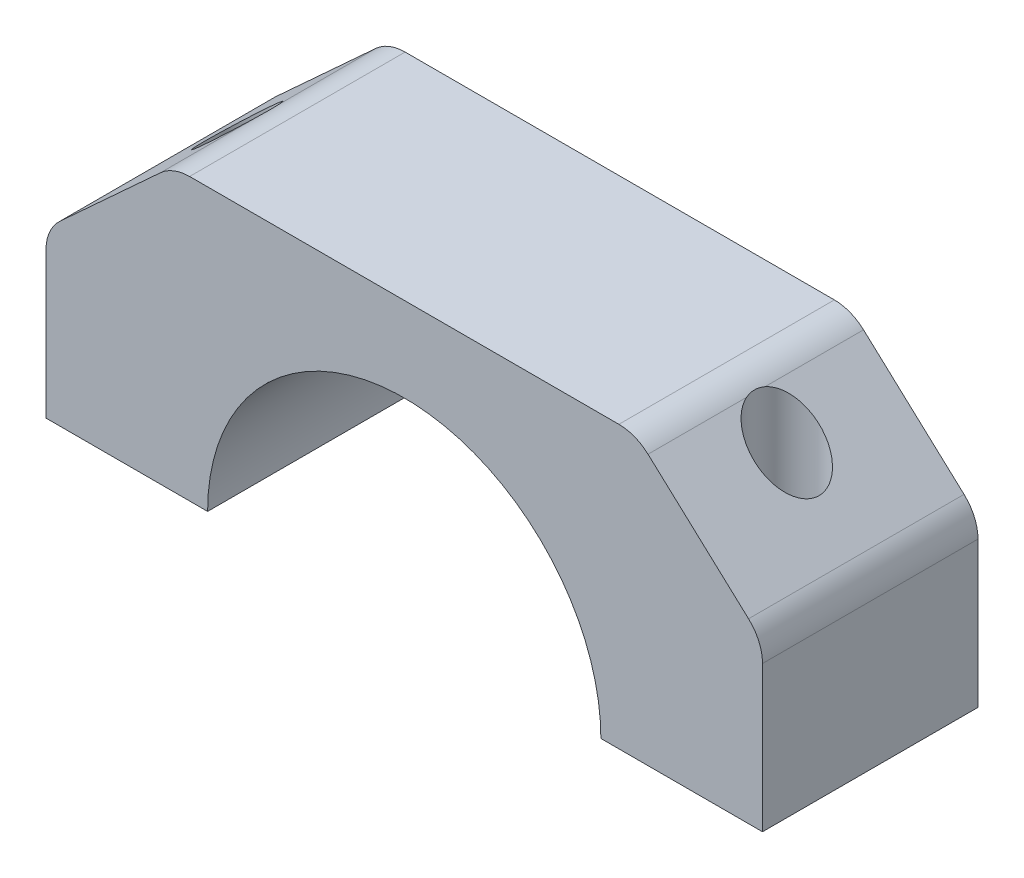
ISO-10303-21;
HEADER;
FILE_DESCRIPTION(('STEP AP214'),'2;1');
FILE_NAME('part.step','',(''),(''),'','','');
FILE_SCHEMA(('AUTOMOTIVE_DESIGN { 1 0 10303 214 1 1 1 1 }'));
ENDSEC;
DATA;
#1=APPLICATION_CONTEXT('core data for automotive mechanical design processes');
#2=APPLICATION_PROTOCOL_DEFINITION('international standard','automotive_design',2000,#1);
#3=PRODUCT_CONTEXT('',#1,'mechanical');
#4=PRODUCT('Part','Part','',(#3));
#5=PRODUCT_RELATED_PRODUCT_CATEGORY('part','',(#4));
#6=PRODUCT_DEFINITION_FORMATION('','',#4);
#7=PRODUCT_DEFINITION_CONTEXT('part definition',#1,'design');
#8=PRODUCT_DEFINITION('design','',#6,#7);
#9=PRODUCT_DEFINITION_SHAPE('','',#8);
#10=(LENGTH_UNIT() NAMED_UNIT(*) SI_UNIT(.MILLI.,.METRE.));
#11=(NAMED_UNIT(*) PLANE_ANGLE_UNIT() SI_UNIT($,.RADIAN.));
#12=(NAMED_UNIT(*) SI_UNIT($,.STERADIAN.) SOLID_ANGLE_UNIT());
#13=UNCERTAINTY_MEASURE_WITH_UNIT(LENGTH_MEASURE(1.E-05),#10,'distance_accuracy_value','');
#14=(GEOMETRIC_REPRESENTATION_CONTEXT(3) GLOBAL_UNCERTAINTY_ASSIGNED_CONTEXT((#13)) GLOBAL_UNIT_ASSIGNED_CONTEXT((#10,
#11,#12)) REPRESENTATION_CONTEXT('',''));
#15=CARTESIAN_POINT('',(0.,0.,0.));
#16=DIRECTION('',(0.,0.,1.));
#17=DIRECTION('',(1.,0.,0.));
#18=AXIS2_PLACEMENT_3D('',#15,#16,#17);
#19=CARTESIAN_POINT('',(-33.25,0.,20.));
#20=DIRECTION('',(1.,0.,0.));
#21=DIRECTION('',(0.,0.,-1.));
#22=AXIS2_PLACEMENT_3D('',#19,#20,#21);
#23=PLANE('',#22);
#24=DIRECTION('',(0.,-1.,0.));
#25=VECTOR('',#24,1.);
#26=CARTESIAN_POINT('',(-33.25,0.,0.));
#27=LINE('',#26,#25);
#28=CARTESIAN_POINT('',(-33.25,13.5274842596528,0.));
#29=VERTEX_POINT('',#28);
#30=CARTESIAN_POINT('',(-33.25,0.,0.));
#31=VERTEX_POINT('',#30);
#32=EDGE_CURVE('E234',#29,#31,#27,.T.);
#33=ORIENTED_EDGE('',*,*,#32,.T.);
#34=DIRECTION('',(0.,0.,-1.));
#35=VECTOR('',#34,1.);
#36=CARTESIAN_POINT('',(-33.25,0.,20.));
#37=LINE('',#36,#35);
#38=CARTESIAN_POINT('',(-33.25,0.,20.));
#39=VERTEX_POINT('',#38);
#40=EDGE_CURVE('E139',#39,#31,#37,.T.);
#41=ORIENTED_EDGE('',*,*,#40,.F.);
#42=DIRECTION('',(0.,-1.,0.));
#43=VECTOR('',#42,1.);
#44=CARTESIAN_POINT('',(-33.25,0.,20.));
#45=LINE('',#44,#43);
#46=CARTESIAN_POINT('',(-33.25,13.5274842596528,20.));
#47=VERTEX_POINT('',#46);
#48=EDGE_CURVE('E235',#47,#39,#45,.T.);
#49=ORIENTED_EDGE('',*,*,#48,.F.);
#50=DIRECTION('',(0.,0.,-1.));
#51=VECTOR('',#50,1.);
#52=CARTESIAN_POINT('',(-33.25,13.5274842596528,20.));
#53=LINE('',#52,#51);
#54=EDGE_CURVE('E260',#47,#29,#53,.T.);
#55=ORIENTED_EDGE('',*,*,#54,.T.);
#56=EDGE_LOOP('',(#33,#41,#49,#55));
#57=FACE_BOUND('',#56,.T.);
#58=ADVANCED_FACE('F37',(#57),#23,.F.);
#59=CARTESIAN_POINT('',(-33.25,0.,20.));
#60=DIRECTION('',(0.,1.,0.));
#61=DIRECTION('',(0.,0.,1.));
#62=AXIS2_PLACEMENT_3D('',#59,#60,#61);
#63=PLANE('',#62);
#64=CARTESIAN_POINT('',(-25.5,0.,10.));
#65=DIRECTION('',(0.,1.,0.));
#66=DIRECTION('',(0.,0.,1.));
#67=AXIS2_PLACEMENT_3D('',#64,#65,#66);
#68=CIRCLE('',#67,1.75);
#69=CARTESIAN_POINT('',(-25.5,0.,11.75));
#70=VERTEX_POINT('',#69);
#71=EDGE_CURVE('E522',#70,#70,#68,.T.);
#72=ORIENTED_EDGE('',*,*,#71,.T.);
#73=EDGE_LOOP('',(#72));
#74=FACE_BOUND('',#73,.T.);
#75=DIRECTION('',(1.,0.,0.));
#76=VECTOR('',#75,1.);
#77=CARTESIAN_POINT('',(-33.25,0.,0.));
#78=LINE('',#77,#76);
#79=CARTESIAN_POINT('',(-18.25,0.,0.));
#80=VERTEX_POINT('',#79);
#81=EDGE_CURVE('E263',#31,#80,#78,.T.);
#82=ORIENTED_EDGE('',*,*,#81,.T.);
#83=DIRECTION('',(0.,0.,-1.));
#84=VECTOR('',#83,1.);
#85=CARTESIAN_POINT('',(-18.25,0.,20.));
#86=LINE('',#85,#84);
#87=CARTESIAN_POINT('',(-18.25,0.,20.));
#88=VERTEX_POINT('',#87);
#89=EDGE_CURVE('E181',#88,#80,#86,.T.);
#90=ORIENTED_EDGE('',*,*,#89,.F.);
#91=DIRECTION('',(1.,0.,0.));
#92=VECTOR('',#91,1.);
#93=CARTESIAN_POINT('',(-33.25,0.,20.));
#94=LINE('',#93,#92);
#95=EDGE_CURVE('E238',#39,#88,#94,.T.);
#96=ORIENTED_EDGE('',*,*,#95,.F.);
#97=ORIENTED_EDGE('',*,*,#40,.T.);
#98=EDGE_LOOP('',(#82,#90,#96,#97));
#99=FACE_BOUND('',#98,.T.);
#100=ADVANCED_FACE('F297',(#74,#99),#63,.F.);
#101=CARTESIAN_POINT('',(0.,0.,20.));
#102=DIRECTION('',(0.,0.,-1.));
#103=DIRECTION('',(-1.,0.,0.));
#104=AXIS2_PLACEMENT_3D('',#101,#102,#103);
#105=CYLINDRICAL_SURFACE('',#104,18.25);
#106=CARTESIAN_POINT('',(0.,0.,0.));
#107=DIRECTION('',(0.,0.,-1.));
#108=DIRECTION('',(1.,0.,0.));
#109=AXIS2_PLACEMENT_3D('',#106,#107,#108);
#110=CIRCLE('',#109,18.25);
#111=CARTESIAN_POINT('',(18.25,0.,0.));
#112=VERTEX_POINT('',#111);
#113=EDGE_CURVE('E265',#80,#112,#110,.T.);
#114=ORIENTED_EDGE('',*,*,#113,.T.);
#115=DIRECTION('',(0.,0.,-1.));
#116=VECTOR('',#115,1.);
#117=CARTESIAN_POINT('',(18.25,0.,20.));
#118=LINE('',#117,#116);
#119=CARTESIAN_POINT('',(18.25,0.,20.));
#120=VERTEX_POINT('',#119);
#121=EDGE_CURVE('E178',#120,#112,#118,.T.);
#122=ORIENTED_EDGE('',*,*,#121,.F.);
#123=CARTESIAN_POINT('',(0.,0.,20.));
#124=DIRECTION('',(0.,0.,-1.));
#125=DIRECTION('',(1.,0.,0.));
#126=AXIS2_PLACEMENT_3D('',#123,#124,#125);
#127=CIRCLE('',#126,18.25);
#128=EDGE_CURVE('E241',#88,#120,#127,.T.);
#129=ORIENTED_EDGE('',*,*,#128,.F.);
#130=ORIENTED_EDGE('',*,*,#89,.T.);
#131=EDGE_LOOP('',(#114,#122,#129,#130));
#132=FACE_BOUND('',#131,.T.);
#133=ADVANCED_FACE('F330',(#132),#105,.F.);
#134=CARTESIAN_POINT('',(18.25,0.,20.));
#135=DIRECTION('',(0.,1.,0.));
#136=DIRECTION('',(0.,0.,1.));
#137=AXIS2_PLACEMENT_3D('',#134,#135,#136);
#138=PLANE('',#137);
#139=CARTESIAN_POINT('',(25.5,0.,10.));
#140=DIRECTION('',(0.,1.,0.));
#141=DIRECTION('',(0.,0.,1.));
#142=AXIS2_PLACEMENT_3D('',#139,#140,#141);
#143=CIRCLE('',#142,1.75);
#144=CARTESIAN_POINT('',(25.5,0.,11.75));
#145=VERTEX_POINT('',#144);
#146=EDGE_CURVE('E525',#145,#145,#143,.T.);
#147=ORIENTED_EDGE('',*,*,#146,.T.);
#148=EDGE_LOOP('',(#147));
#149=FACE_BOUND('',#148,.T.);
#150=DIRECTION('',(1.,0.,0.));
#151=VECTOR('',#150,1.);
#152=CARTESIAN_POINT('',(18.25,0.,0.));
#153=LINE('',#152,#151);
#154=CARTESIAN_POINT('',(33.25,0.,0.));
#155=VERTEX_POINT('',#154);
#156=EDGE_CURVE('E267',#112,#155,#153,.T.);
#157=ORIENTED_EDGE('',*,*,#156,.T.);
#158=DIRECTION('',(0.,0.,-1.));
#159=VECTOR('',#158,1.);
#160=CARTESIAN_POINT('',(33.25,0.,20.));
#161=LINE('',#160,#159);
#162=CARTESIAN_POINT('',(33.25,0.,20.));
#163=VERTEX_POINT('',#162);
#164=EDGE_CURVE('E175',#163,#155,#161,.T.);
#165=ORIENTED_EDGE('',*,*,#164,.F.);
#166=DIRECTION('',(1.,0.,0.));
#167=VECTOR('',#166,1.);
#168=CARTESIAN_POINT('',(18.25,0.,20.));
#169=LINE('',#168,#167);
#170=EDGE_CURVE('E243',#120,#163,#169,.T.);
#171=ORIENTED_EDGE('',*,*,#170,.F.);
#172=ORIENTED_EDGE('',*,*,#121,.T.);
#173=EDGE_LOOP('',(#157,#165,#171,#172));
#174=FACE_BOUND('',#173,.T.);
#175=ADVANCED_FACE('F327',(#149,#174),#138,.F.);
#176=CARTESIAN_POINT('',(33.25,13.5274842596528,20.));
#177=DIRECTION('',(-1.,0.,0.));
#178=DIRECTION('',(0.,0.,1.));
#179=AXIS2_PLACEMENT_3D('',#176,#177,#178);
#180=PLANE('',#179);
#181=DIRECTION('',(0.,1.,0.));
#182=VECTOR('',#181,1.);
#183=CARTESIAN_POINT('',(33.25,13.5274842596528,0.));
#184=LINE('',#183,#182);
#185=CARTESIAN_POINT('',(33.25,13.5274842596528,0.));
#186=VERTEX_POINT('',#185);
#187=EDGE_CURVE('E269',#155,#186,#184,.T.);
#188=ORIENTED_EDGE('',*,*,#187,.T.);
#189=DIRECTION('',(0.,0.,-1.));
#190=VECTOR('',#189,1.);
#191=CARTESIAN_POINT('',(33.25,13.5274842596528,20.));
#192=LINE('',#191,#190);
#193=CARTESIAN_POINT('',(33.25,13.5274842596528,20.));
#194=VERTEX_POINT('',#193);
#195=EDGE_CURVE('E172',#194,#186,#192,.T.);
#196=ORIENTED_EDGE('',*,*,#195,.F.);
#197=DIRECTION('',(0.,1.,0.));
#198=VECTOR('',#197,1.);
#199=CARTESIAN_POINT('',(33.25,13.5274842596528,20.));
#200=LINE('',#199,#198);
#201=EDGE_CURVE('E245',#163,#194,#200,.T.);
#202=ORIENTED_EDGE('',*,*,#201,.F.);
#203=ORIENTED_EDGE('',*,*,#164,.T.);
#204=EDGE_LOOP('',(#188,#196,#202,#203));
#205=FACE_BOUND('',#204,.T.);
#206=ADVANCED_FACE('F323',(#205),#180,.F.);
#207=CARTESIAN_POINT('',(29.25,13.5274842596528,20.));
#208=DIRECTION('',(0.,0.,-1.));
#209=DIRECTION('',(-1.,0.,0.));
#210=AXIS2_PLACEMENT_3D('',#207,#208,#209);
#211=CYLINDRICAL_SURFACE('',#210,4.);
#212=CARTESIAN_POINT('',(29.25,13.5274842596528,0.));
#213=DIRECTION('',(0.,0.,1.));
#214=DIRECTION('',(-1.,0.,0.));
#215=AXIS2_PLACEMENT_3D('',#212,#213,#214);
#216=CIRCLE('',#215,4.);
#217=CARTESIAN_POINT('',(31.9543806038736,16.474741552356,0.));
#218=VERTEX_POINT('',#217);
#219=EDGE_CURVE('E271',#186,#218,#216,.T.);
#220=ORIENTED_EDGE('',*,*,#219,.T.);
#221=DIRECTION('',(0.,0.,-1.));
#222=VECTOR('',#221,1.);
#223=CARTESIAN_POINT('',(31.9543806038736,16.474741552356,20.));
#224=LINE('',#223,#222);
#225=CARTESIAN_POINT('',(31.9543806038736,16.474741552356,20.));
#226=VERTEX_POINT('',#225);
#227=EDGE_CURVE('E169',#226,#218,#224,.T.);
#228=ORIENTED_EDGE('',*,*,#227,.F.);
#229=CARTESIAN_POINT('',(29.25,13.5274842596528,20.));
#230=DIRECTION('',(0.,0.,1.));
#231=DIRECTION('',(-1.,0.,0.));
#232=AXIS2_PLACEMENT_3D('',#229,#230,#231);
#233=CIRCLE('',#232,4.);
#234=EDGE_CURVE('E247',#194,#226,#233,.T.);
#235=ORIENTED_EDGE('',*,*,#234,.F.);
#236=ORIENTED_EDGE('',*,*,#195,.T.);
#237=EDGE_LOOP('',(#220,#228,#235,#236));
#238=FACE_BOUND('',#237,.T.);
#239=ADVANCED_FACE('F318',(#238),#211,.T.);
#240=CARTESIAN_POINT('',(22.624644972967,25.0356351472107,20.));
#241=DIRECTION('',(-0.676095150968395,-0.736814323175807,0.));
#242=DIRECTION('',(0.736814323175807,-0.676095150968395,0.));
#243=AXIS2_PLACEMENT_3D('',#240,#241,#242);
#244=PLANE('',#243);
#245=DIRECTION('',(0.,0.,-1.));
#246=VECTOR('',#245,1.);
#247=CARTESIAN_POINT('',(22.624644972967,25.0356351472107,20.));
#248=LINE('',#247,#246);
#249=CARTESIAN_POINT('',(22.624644972967,25.0356351472107,9.14423515583059));
#250=VERTEX_POINT('',#249);
#251=CARTESIAN_POINT('',(22.624644972967,25.0356351472107,0.));
#252=VERTEX_POINT('',#251);
#253=EDGE_CURVE('E165',#250,#252,#248,.T.);
#254=ORIENTED_EDGE('',*,*,#253,.F.);
#255=CARTESIAN_POINT('',(25.5,22.3972315088144,10.));
#256=DIRECTION('',(-0.676095150968395,-0.736814323175807,0.));
#257=DIRECTION('',(-0.736814323175807,0.676095150968395,0.));
#258=AXIS2_PLACEMENT_3D('',#255,#256,#257);
#259=ELLIPSE('',#258,4.07158208742393,3.);
#260=CARTESIAN_POINT('',(22.624644972967,25.0356351472108,10.8557648441695));
#261=VERTEX_POINT('',#260);
#262=EDGE_CURVE('E52',#250,#261,#259,.T.);
#263=ORIENTED_EDGE('',*,*,#262,.T.);
#264=CARTESIAN_POINT('',(22.624644972967,25.0356351472107,20.));
#265=VERTEX_POINT('',#264);
#266=EDGE_CURVE('E166',#265,#261,#248,.T.);
#267=ORIENTED_EDGE('',*,*,#266,.F.);
#268=DIRECTION('',(-0.736814323175807,0.676095150968395,0.));
#269=VECTOR('',#268,1.);
#270=CARTESIAN_POINT('',(22.624644972967,25.0356351472107,20.));
#271=LINE('',#270,#269);
#272=EDGE_CURVE('E249',#226,#265,#271,.T.);
#273=ORIENTED_EDGE('',*,*,#272,.F.);
#274=ORIENTED_EDGE('',*,*,#227,.T.);
#275=DIRECTION('',(-0.736814323175807,0.676095150968395,0.));
#276=VECTOR('',#275,1.);
#277=CARTESIAN_POINT('',(22.624644972967,25.0356351472107,0.));
#278=LINE('',#277,#276);
#279=EDGE_CURVE('E273',#218,#252,#278,.T.);
#280=ORIENTED_EDGE('',*,*,#279,.T.);
#281=EDGE_LOOP('',(#254,#263,#267,#273,#274,#280));
#282=FACE_BOUND('',#281,.T.);
#283=ADVANCED_FACE('F311',(#282),#244,.F.);
#284=CARTESIAN_POINT('',(19.9202643690935,22.0883778545075,20.));
#285=DIRECTION('',(0.,0.,-1.));
#286=DIRECTION('',(-1.,0.,0.));
#287=AXIS2_PLACEMENT_3D('',#284,#285,#286);
#288=CYLINDRICAL_SURFACE('',#287,3.99999999999999);
#289=ORIENTED_EDGE('',*,*,#266,.T.);
#290=CARTESIAN_POINT('',(23.9202643690935,22.0883778545075,12.5503794495024));
#291=CARTESIAN_POINT('',(23.9202640576877,22.1797027572476,12.5503798666922));
#292=CARTESIAN_POINT('',(23.9171326003737,22.271053298897,12.548447721546));
#293=CARTESIAN_POINT('',(23.9046396790926,22.4531981090026,12.5406453760121));
#294=CARTESIAN_POINT('',(23.8952746920701,22.5439920335686,12.5347729486474));
#295=CARTESIAN_POINT('',(23.8703950993666,22.7246150076462,12.5188503164251));
#296=CARTESIAN_POINT('',(23.8548644244259,22.8144409008506,12.5087891914562));
#297=CARTESIAN_POINT('',(23.8178661887057,22.9922270113921,12.4841336427383));
#298=CARTESIAN_POINT('',(23.7963990096124,23.0801873482834,12.4695395104306));
#299=CARTESIAN_POINT('',(23.7477407170185,23.2539690881206,12.4352570999327));
#300=CARTESIAN_POINT('',(23.7205229705697,23.339778384977,12.4155450179158));
#301=CARTESIAN_POINT('',(23.6609107982801,23.5080728518339,12.3704740408423));
#302=CARTESIAN_POINT('',(23.6285158019871,23.5905576542714,12.345114523405));
#303=CARTESIAN_POINT('',(23.5593072374848,23.7512046135071,12.2881679893508));
#304=CARTESIAN_POINT('',(23.5225036422684,23.8293759636226,12.2565949284721));
#305=CARTESIAN_POINT('',(23.4453661859469,23.9806990236724,12.1865938232251));
#306=CARTESIAN_POINT('',(23.405033674513,24.0538526337632,12.1481683938309));
#307=CARTESIAN_POINT('',(23.301741561818,24.2285320813529,12.0433755593247));
#308=CARTESIAN_POINT('',(23.2373115970781,24.3265681686209,11.97250430053));
#309=CARTESIAN_POINT('',(23.1080390323945,24.5071492239913,11.8135542406097));
#310=CARTESIAN_POINT('',(23.0431966862938,24.5897029176004,11.725485189225));
#311=CARTESIAN_POINT('',(22.9184093847129,24.738015087943,11.532518279039));
#312=CARTESIAN_POINT('',(22.8584821726233,24.8037143929683,11.4275631796892));
#313=CARTESIAN_POINT('',(22.7491603377236,24.9174437861623,11.2034975759538));
#314=CARTESIAN_POINT('',(22.6997670921774,24.9654715644611,11.0843852237442));
#315=CARTESIAN_POINT('',(22.6184157962483,25.0418344067532,10.8435721390359));
#316=CARTESIAN_POINT('',(22.585556831424,25.0712177120253,10.722504941638));
#317=CARTESIAN_POINT('',(22.5350946867662,25.1155549213269,10.4746840286434));
#318=CARTESIAN_POINT('',(22.5174913212198,25.1305090010097,10.34793038229));
#319=CARTESIAN_POINT('',(22.4987014008597,25.1464518125892,10.0925812473955));
#320=CARTESIAN_POINT('',(22.4974855127959,25.1474654975739,9.96398946238325));
#321=CARTESIAN_POINT('',(22.5114683286295,25.1356297005536,9.70834313624793));
#322=CARTESIAN_POINT('',(22.5266669216297,25.1227803122083,9.5812885847451));
#323=CARTESIAN_POINT('',(22.5726246767774,25.0826911082009,9.3316784294643));
#324=CARTESIAN_POINT('',(22.6034620000208,25.0553789783546,9.20914877350597));
#325=CARTESIAN_POINT('',(22.6785951610255,24.9856557513153,8.97284966071268));
#326=CARTESIAN_POINT('',(22.7228877312755,24.9432483194804,8.85907808543815));
#327=CARTESIAN_POINT('',(22.8211902415412,24.8432780563189,8.64434110891897));
#328=CARTESIAN_POINT('',(22.8751155384785,24.7858453586319,8.54327627614127));
#329=CARTESIAN_POINT('',(22.9887295635653,24.6558566922804,8.35512528710186));
#330=CARTESIAN_POINT('',(23.0484180413222,24.583301380489,8.26803852397275));
#331=CARTESIAN_POINT('',(23.1699577062134,24.4228507122477,8.10758941387105));
#332=CARTESIAN_POINT('',(23.231828276678,24.3347251930498,8.03447314387443));
#333=CARTESIAN_POINT('',(23.3523435629146,24.1458982799355,7.90345082570833));
#334=CARTESIAN_POINT('',(23.4109868768255,24.0451914820933,7.84555134684151));
#335=CARTESIAN_POINT('',(23.5268842972078,23.8231580551651,7.73866241862741));
#336=CARTESIAN_POINT('',(23.5834349773105,23.7007776024798,7.69110862095873));
#337=CARTESIAN_POINT('',(23.6850125062106,23.4468404670791,7.61043249993644));
#338=CARTESIAN_POINT('',(23.7300324962517,23.3152783818128,7.57731875771682));
#339=CARTESIAN_POINT('',(23.8126789670261,23.0240892384041,7.51888467771657));
#340=CARTESIAN_POINT('',(23.8479336044287,22.8633634728115,7.49568966381546));
#341=CARTESIAN_POINT('',(23.8984134905471,22.5373350975679,7.46310583869987));
#342=CARTESIAN_POINT('',(23.9136262658305,22.3720297029722,7.45372562496022));
#343=CARTESIAN_POINT('',(23.9212726352131,22.1133863048307,7.44900103795881));
#344=CARTESIAN_POINT('',(23.9207675869496,22.0202591480454,7.44930693095534));
#345=CARTESIAN_POINT('',(23.913271937876,21.8343392982233,7.45395938252531));
#346=CARTESIAN_POINT('',(23.906280759206,21.7415466357265,7.45830630112038));
#347=CARTESIAN_POINT('',(23.8858874930167,21.5568987366592,7.47120896123993));
#348=CARTESIAN_POINT('',(23.8724808636074,21.4650442113804,7.4797676846807));
#349=CARTESIAN_POINT('',(23.8394382465213,21.2830010256961,7.50141531709855));
#350=CARTESIAN_POINT('',(23.8198024237136,21.192812321268,7.51450410617853));
#351=CARTESIAN_POINT('',(23.7742454124131,21.0134247858525,7.54591189930906));
#352=CARTESIAN_POINT('',(23.748231440361,20.9242630177087,7.56430889331427));
#353=CARTESIAN_POINT('',(23.6905482713538,20.7491784594593,7.606849624684));
#354=CARTESIAN_POINT('',(23.6588785276413,20.6632559834776,7.63099391772946));
#355=CARTESIAN_POINT('',(23.5906111259847,20.4956696764312,7.68566623168155));
#356=CARTESIAN_POINT('',(23.5540224270213,20.4139984690634,7.71618270145735));
#357=CARTESIAN_POINT('',(23.4768210370083,20.2557108852258,7.78428438946117));
#358=CARTESIAN_POINT('',(23.436209992082,20.1790924621412,7.82186672163306));
#359=CARTESIAN_POINT('',(23.3328071848137,19.9979736622436,7.9237811947826));
#360=CARTESIAN_POINT('',(23.2683797597795,19.8967874441403,7.99247909277793));
#361=CARTESIAN_POINT('',(23.1382601084359,19.7098277218274,8.14733402644666));
#362=CARTESIAN_POINT('',(23.0725688385266,19.6240430341696,8.23347829634197));
#363=CARTESIAN_POINT('',(22.9452813313072,19.4693377842004,8.4231427167523));
#364=CARTESIAN_POINT('',(22.8837019615789,19.4004839077303,8.52672895223263));
#365=CARTESIAN_POINT('',(22.770550736955,19.2807632967091,8.74875535054132));
#366=CARTESIAN_POINT('',(22.7189800406173,19.2298986439482,8.86719723038146));
#367=CARTESIAN_POINT('',(22.6334757461895,19.1486956568903,9.1066429156332));
#368=CARTESIAN_POINT('',(22.5985701577706,19.1171824559605,9.22690504182991));
#369=CARTESIAN_POINT('',(22.5438359712162,19.0687389091119,9.47363582311949));
#370=CARTESIAN_POINT('',(22.524007077557,19.0518082773543,9.60010435650673));
#371=CARTESIAN_POINT('',(22.5007853148577,19.0320490783291,9.85501552083658));
#372=CARTESIAN_POINT('',(22.497315972654,19.0291548954884,9.98344614558988));
#373=CARTESIAN_POINT('',(22.5068188365909,19.0371857419789,10.2392658080783));
#374=CARTESIAN_POINT('',(22.5197910929657,19.0481108135322,10.3666548426298));
#375=CARTESIAN_POINT('',(22.5614804676708,19.0842578610737,10.6175474565802));
#376=CARTESIAN_POINT('',(22.5902907238664,19.1095644398001,10.7410234370106));
#377=CARTESIAN_POINT('',(22.6617385725977,19.1751914630611,10.9796836252661));
#378=CARTESIAN_POINT('',(22.7043729094421,19.2155083728632,11.0948697776206));
#379=CARTESIAN_POINT('',(22.7999098534477,19.3113012236125,11.3128455101121));
#380=CARTESIAN_POINT('',(22.852726653377,19.3666519664,11.4157277884612));
#381=CARTESIAN_POINT('',(22.9647437368237,19.4925696815029,11.6077448577121));
#382=CARTESIAN_POINT('',(23.0239436917607,19.563135870772,11.6968803556722));
#383=CARTESIAN_POINT('',(23.1449027344354,19.7195013099559,11.861203017842));
#384=CARTESIAN_POINT('',(23.2066845839649,19.8054802298397,11.9362015608736));
#385=CARTESIAN_POINT('',(23.3276006056168,19.9902225722689,12.0709659231185));
#386=CARTESIAN_POINT('',(23.3867340147611,20.0889896474197,12.1307273757155));
#387=CARTESIAN_POINT('',(23.5037991237867,20.3065555776035,12.2410383698981));
#388=CARTESIAN_POINT('',(23.5611225379156,20.4263609590105,12.2902392408983));
#389=CARTESIAN_POINT('',(23.6648509430454,20.6754628723543,12.3741711027939));
#390=CARTESIAN_POINT('',(23.7112435835238,20.8047699258217,12.4088857597377));
#391=CARTESIAN_POINT('',(23.7973386082245,21.0913165432081,12.4706707715759));
#392=CARTESIAN_POINT('',(23.8347574447946,21.2496990161183,12.4956071851183));
#393=CARTESIAN_POINT('',(23.8900273001446,21.5711410268921,12.5316152133062));
#394=CARTESIAN_POINT('',(23.9079101675564,21.7341925063091,12.5427093985381));
#395=CARTESIAN_POINT('',(23.9172334369607,21.9294597740779,12.5484987880379));
#396=CARTESIAN_POINT('',(23.9183695053248,21.9612268338228,12.5492046339827));
#397=CARTESIAN_POINT('',(23.9198850178753,22.0247875115731,12.5501448872735));
#398=CARTESIAN_POINT('',(23.920264477516,22.0565811290228,12.5503793042488));
#399=CARTESIAN_POINT('',(23.9202643690935,22.0883778545075,12.5503794495024));
#400=B_SPLINE_CURVE_WITH_KNOTS('',3,(#290,#291,#292,#293,#294,#295,#296,#297,#298,#299,#300,
#301,#302,#303,#304,#305,#306,#307,#308,#309,#310,#311,#312,#313,#314,#315,#316,#317,#318,#319,
#320,#321,#322,#323,#324,#325,#326,#327,#328,#329,#330,#331,#332,#333,#334,#335,#336,#337,#338,
#339,#340,#341,#342,#343,#344,#345,#346,#347,#348,#349,#350,#351,#352,#353,#354,#355,#356,#357,
#358,#359,#360,#361,#362,#363,#364,#365,#366,#367,#368,#369,#370,#371,#372,#373,#374,#375,#376,
#377,#378,#379,#380,#381,#382,#383,#384,#385,#386,#387,#388,#389,#390,#391,#392,#393,#394,#395,
#396,#397,#398,#399),.UNSPECIFIED.,.T.,.F.,(4,2,2,2,2,2,2,2,2,2,2,2,2,2,2,2,2,2,2,2,2,2,2,2,2,2,
2,2,2,2,2,2,2,2,2,2,2,2,2,2,2,2,2,2,2,2,2,2,2,2,2,2,2,2,4),(0.,0.273944730345362,
0.548044419913488,0.822863218649025,1.09766435207932,1.37376723721645,1.64990056559169,
1.92542062936583,2.20083577438255,2.61010308373557,3.01913904210824,3.4295919597082,
3.84009850913798,4.22479661104726,4.60949002979751,4.99349476354506,5.37749690294918,
5.76343745120237,6.14928435135027,6.53189412513813,6.91448728316707,7.30329894040634,
7.69227817839464,8.11950019905018,8.5469757554372,9.04355814364493,9.54044944353391,
9.81956794110646,10.0987113081885,10.3780525909705,10.657386481002,10.9410538796603,
11.2247487160131,11.5079336823798,11.7910032319628,12.2038009461744,12.6162976942292,
13.0303940260123,13.4445382631291,13.8300845509172,14.2156232812862,14.5993580019361,
14.9830938950191,15.3691109291374,15.7550371188382,16.1378430467616,16.5206292786937,
16.908208373112,17.2958984146769,17.7191667429328,18.1429110467853,18.6349540286939,
19.1261936519315,19.2215753392149,19.3169550782282),.UNSPECIFIED.);
#401=EDGE_CURVE('E11',#261,#250,#400,.T.);
#402=ORIENTED_EDGE('',*,*,#401,.T.);
#403=ORIENTED_EDGE('',*,*,#253,.T.);
#404=CARTESIAN_POINT('',(19.9202643690935,22.0883778545075,0.));
#405=DIRECTION('',(0.,0.,1.));
#406=DIRECTION('',(-1.,0.,0.));
#407=AXIS2_PLACEMENT_3D('',#404,#405,#406);
#408=CIRCLE('',#407,3.99999999999999);
#409=CARTESIAN_POINT('',(19.9202643690935,26.0883778545075,0.));
#410=VERTEX_POINT('',#409);
#411=EDGE_CURVE('E276',#252,#410,#408,.T.);
#412=ORIENTED_EDGE('',*,*,#411,.T.);
#413=DIRECTION('',(0.,0.,-1.));
#414=VECTOR('',#413,1.);
#415=CARTESIAN_POINT('',(19.9202643690935,26.0883778545075,20.));
#416=LINE('',#415,#414);
#417=CARTESIAN_POINT('',(19.9202643690935,26.0883778545075,20.));
#418=VERTEX_POINT('',#417);
#419=EDGE_CURVE('E157',#418,#410,#416,.T.);
#420=ORIENTED_EDGE('',*,*,#419,.F.);
#421=CARTESIAN_POINT('',(19.9202643690935,22.0883778545075,20.));
#422=DIRECTION('',(0.,0.,1.));
#423=DIRECTION('',(-1.,0.,0.));
#424=AXIS2_PLACEMENT_3D('',#421,#422,#423);
#425=CIRCLE('',#424,3.99999999999999);
#426=EDGE_CURVE('E251',#265,#418,#425,.T.);
#427=ORIENTED_EDGE('',*,*,#426,.F.);
#428=EDGE_LOOP('',(#289,#402,#403,#412,#420,#427));
#429=FACE_BOUND('',#428,.T.);
#430=ADVANCED_FACE('F191',(#429),#288,.T.);
#431=CARTESIAN_POINT('',(-19.9202643690935,26.0883778545075,20.));
#432=DIRECTION('',(0.,-1.,0.));
#433=DIRECTION('',(0.,0.,-1.));
#434=AXIS2_PLACEMENT_3D('',#431,#432,#433);
#435=PLANE('',#434);
#436=DIRECTION('',(-1.,0.,0.));
#437=VECTOR('',#436,1.);
#438=CARTESIAN_POINT('',(-19.9202643690935,26.0883778545075,0.));
#439=LINE('',#438,#437);
#440=CARTESIAN_POINT('',(-19.9202643690935,26.0883778545075,0.));
#441=VERTEX_POINT('',#440);
#442=EDGE_CURVE('E278',#410,#441,#439,.T.);
#443=ORIENTED_EDGE('',*,*,#442,.T.);
#444=DIRECTION('',(0.,0.,-1.));
#445=VECTOR('',#444,1.);
#446=CARTESIAN_POINT('',(-19.9202643690935,26.0883778545075,20.));
#447=LINE('',#446,#445);
#448=CARTESIAN_POINT('',(-19.9202643690935,26.0883778545075,20.));
#449=VERTEX_POINT('',#448);
#450=EDGE_CURVE('E154',#449,#441,#447,.T.);
#451=ORIENTED_EDGE('',*,*,#450,.F.);
#452=DIRECTION('',(-1.,0.,0.));
#453=VECTOR('',#452,1.);
#454=CARTESIAN_POINT('',(-19.9202643690935,26.0883778545075,20.));
#455=LINE('',#454,#453);
#456=EDGE_CURVE('E253',#418,#449,#455,.T.);
#457=ORIENTED_EDGE('',*,*,#456,.F.);
#458=ORIENTED_EDGE('',*,*,#419,.T.);
#459=EDGE_LOOP('',(#443,#451,#457,#458));
#460=FACE_BOUND('',#459,.T.);
#461=ADVANCED_FACE('F225',(#460),#435,.F.);
#462=CARTESIAN_POINT('',(-19.9202643690935,22.0883778545075,20.));
#463=DIRECTION('',(0.,0.,-1.));
#464=DIRECTION('',(-1.,0.,0.));
#465=AXIS2_PLACEMENT_3D('',#462,#463,#464);
#466=CYLINDRICAL_SURFACE('',#465,4.);
#467=DIRECTION('',(0.,0.,-1.));
#468=VECTOR('',#467,1.);
#469=CARTESIAN_POINT('',(-22.624644972967,25.0356351472107,20.));
#470=LINE('',#469,#468);
#471=CARTESIAN_POINT('',(-22.624644972967,25.0356351472107,9.14423515583057));
#472=VERTEX_POINT('',#471);
#473=CARTESIAN_POINT('',(-22.624644972967,25.0356351472107,0.));
#474=VERTEX_POINT('',#473);
#475=EDGE_CURVE('E148',#472,#474,#470,.T.);
#476=ORIENTED_EDGE('',*,*,#475,.F.);
#477=CARTESIAN_POINT('',(-23.9202643690935,22.0883778545075,12.5503794495024));
#478=CARTESIAN_POINT('',(-23.9202640576877,21.9970529517673,12.5503798666922));
#479=CARTESIAN_POINT('',(-23.9171326003737,21.9057024101179,12.548447721546));
#480=CARTESIAN_POINT('',(-23.9046396790926,21.7235576000124,12.5406453760121));
#481=CARTESIAN_POINT('',(-23.8952746920701,21.6327636754464,12.5347729486474));
#482=CARTESIAN_POINT('',(-23.8703950993666,21.4521407013688,12.5188503164251));
#483=CARTESIAN_POINT('',(-23.8548644244259,21.3623148081644,12.5087891914562));
#484=CARTESIAN_POINT('',(-23.8178661887057,21.1845286976229,12.4841336427383));
#485=CARTESIAN_POINT('',(-23.7963990096124,21.0965683607316,12.4695395104306));
#486=CARTESIAN_POINT('',(-23.7477407170185,20.9227866208943,12.4352570999327));
#487=CARTESIAN_POINT('',(-23.7205229705697,20.836977324038,12.4155450179158));
#488=CARTESIAN_POINT('',(-23.6609107982801,20.6686828571811,12.3704740408423));
#489=CARTESIAN_POINT('',(-23.6285158019871,20.5861980547435,12.345114523405));
#490=CARTESIAN_POINT('',(-23.5593072374848,20.4255510955078,12.2881679893508));
#491=CARTESIAN_POINT('',(-23.5225036422684,20.3473797453924,12.2565949284721));
#492=CARTESIAN_POINT('',(-23.4453661859469,20.1960566853426,12.1865938232252));
#493=CARTESIAN_POINT('',(-23.405033674513,20.1229030752518,12.1481683938309));
#494=CARTESIAN_POINT('',(-23.301741561818,19.948223627662,12.0433755593247));
#495=CARTESIAN_POINT('',(-23.2373115970781,19.850187540394,11.97250430053));
#496=CARTESIAN_POINT('',(-23.1080390323945,19.6696064850236,11.8135542406097));
#497=CARTESIAN_POINT('',(-23.0431966862938,19.5870527914146,11.725485189225));
#498=CARTESIAN_POINT('',(-22.9184093847129,19.4387406210719,11.532518279039));
#499=CARTESIAN_POINT('',(-22.8584821726233,19.3730413160467,11.4275631796892));
#500=CARTESIAN_POINT('',(-22.7491603377236,19.2593119228527,11.2034975759538));
#501=CARTESIAN_POINT('',(-22.6997670921774,19.2112841445538,11.0843852237443));
#502=CARTESIAN_POINT('',(-22.6184157962483,19.1349213022617,10.8435721390359));
#503=CARTESIAN_POINT('',(-22.585556831424,19.1055379969897,10.722504941638));
#504=CARTESIAN_POINT('',(-22.5350946867662,19.0612007876881,10.4746840286434));
#505=CARTESIAN_POINT('',(-22.5174913212198,19.0462467080052,10.34793038229));
#506=CARTESIAN_POINT('',(-22.4987014008597,19.0303038964257,10.0925812473955));
#507=CARTESIAN_POINT('',(-22.4974855127959,19.029290211441,9.96398946238326));
#508=CARTESIAN_POINT('',(-22.5114683286295,19.0411260084614,9.70834313624793));
#509=CARTESIAN_POINT('',(-22.5266669216297,19.0539753968066,9.58128858474511));
#510=CARTESIAN_POINT('',(-22.5726246767774,19.094064600814,9.33167842946431));
#511=CARTESIAN_POINT('',(-22.6034620000208,19.1213767306604,9.20914877350597));
#512=CARTESIAN_POINT('',(-22.6785951610255,19.1910999576997,8.97284966071269));
#513=CARTESIAN_POINT('',(-22.7228877312755,19.2335073895345,8.85907808543816));
#514=CARTESIAN_POINT('',(-22.8211902415412,19.3334776526961,8.64434110891897));
#515=CARTESIAN_POINT('',(-22.8751155384785,19.3909103503831,8.54327627614128));
#516=CARTESIAN_POINT('',(-22.9887295635653,19.5208990167346,8.35512528710187));
#517=CARTESIAN_POINT('',(-23.0484180413222,19.593454328526,8.26803852397275));
#518=CARTESIAN_POINT('',(-23.1699577062134,19.7539049967672,8.10758941387106));
#519=CARTESIAN_POINT('',(-23.231828276678,19.8420305159651,8.03447314387443));
#520=CARTESIAN_POINT('',(-23.3523435629146,20.0308574290795,7.90345082570833));
#521=CARTESIAN_POINT('',(-23.4109868768255,20.1315642269217,7.84555134684151));
#522=CARTESIAN_POINT('',(-23.5268842972078,20.3535976538499,7.73866241862742));
#523=CARTESIAN_POINT('',(-23.5834349773105,20.4759781065352,7.69110862095873));
#524=CARTESIAN_POINT('',(-23.6850125062105,20.7299152419359,7.61043249993644));
#525=CARTESIAN_POINT('',(-23.7300324962517,20.8614773272021,7.57731875771682));
#526=CARTESIAN_POINT('',(-23.8126789670261,21.1526664706108,7.51888467771657));
#527=CARTESIAN_POINT('',(-23.8479336044287,21.3133922362035,7.49568966381546));
#528=CARTESIAN_POINT('',(-23.8984134905471,21.639420611447,7.46310583869987));
#529=CARTESIAN_POINT('',(-23.9136262658305,21.8047260060427,7.45372562496022));
#530=CARTESIAN_POINT('',(-23.9212726352131,22.0633694041843,7.44900103795881));
#531=CARTESIAN_POINT('',(-23.9207675869496,22.1564965609696,7.44930693095533));
#532=CARTESIAN_POINT('',(-23.913271937876,22.3424164107917,7.45395938252531));
#533=CARTESIAN_POINT('',(-23.906280759206,22.4352090732884,7.45830630112038));
#534=CARTESIAN_POINT('',(-23.8858874930167,22.6198569723558,7.47120896123992));
#535=CARTESIAN_POINT('',(-23.8724808636074,22.7117114976346,7.4797676846807));
#536=CARTESIAN_POINT('',(-23.8394382465213,22.8937546833188,7.50141531709855));
#537=CARTESIAN_POINT('',(-23.8198024237136,22.983943387747,7.51450410617853));
#538=CARTESIAN_POINT('',(-23.7742454124131,23.1633309231625,7.54591189930906));
#539=CARTESIAN_POINT('',(-23.748231440361,23.2524926913063,7.56430889331427));
#540=CARTESIAN_POINT('',(-23.6905482713538,23.4275772495557,7.606849624684));
#541=CARTESIAN_POINT('',(-23.6588785276413,23.5134997255373,7.63099391772946));
#542=CARTESIAN_POINT('',(-23.5906111259847,23.6810860325838,7.68566623168154));
#543=CARTESIAN_POINT('',(-23.5540224270213,23.7627572399515,7.71618270145734));
#544=CARTESIAN_POINT('',(-23.4768210370083,23.9210448237892,7.78428438946116));
#545=CARTESIAN_POINT('',(-23.436209992082,23.9976632468738,7.82186672163305));
#546=CARTESIAN_POINT('',(-23.3328071848137,24.1787820467714,7.92378119478259));
#547=CARTESIAN_POINT('',(-23.2683797597795,24.2799682648747,7.99247909277792));
#548=CARTESIAN_POINT('',(-23.1382601084359,24.4669279871875,8.14733402644666));
#549=CARTESIAN_POINT('',(-23.0725688385266,24.5527126748453,8.23347829634196));
#550=CARTESIAN_POINT('',(-22.9452813313072,24.7074179248146,8.4231427167523));
#551=CARTESIAN_POINT('',(-22.8837019615789,24.7762718012847,8.52672895223262));
#552=CARTESIAN_POINT('',(-22.770550736955,24.8959924123058,8.74875535054132));
#553=CARTESIAN_POINT('',(-22.7189800406173,24.9468570650668,8.86719723038146));
#554=CARTESIAN_POINT('',(-22.6334757461895,25.0280600521246,9.1066429156332));
#555=CARTESIAN_POINT('',(-22.5985701577706,25.0595732530544,9.22690504182991));
#556=CARTESIAN_POINT('',(-22.5438359712162,25.1080167999031,9.47363582311949));
#557=CARTESIAN_POINT('',(-22.524007077557,25.1249474316607,9.60010435650673));
#558=CARTESIAN_POINT('',(-22.5007853148577,25.1447066306859,9.85501552083658));
#559=CARTESIAN_POINT('',(-22.497315972654,25.1476008135265,9.98344614558987));
#560=CARTESIAN_POINT('',(-22.5068188365909,25.139569967036,10.2392658080783));
#561=CARTESIAN_POINT('',(-22.5197910929657,25.1286448954828,10.3666548426298));
#562=CARTESIAN_POINT('',(-22.5614804676708,25.0924978479412,10.6175474565802));
#563=CARTESIAN_POINT('',(-22.5902907238664,25.0671912692149,10.7410234370106));
#564=CARTESIAN_POINT('',(-22.6617385725977,25.0015642459539,10.9796836252661));
#565=CARTESIAN_POINT('',(-22.7043729094421,24.9612473361517,11.0948697776206));
#566=CARTESIAN_POINT('',(-22.7999098534477,24.8654544854024,11.3128455101121));
#567=CARTESIAN_POINT('',(-22.852726653377,24.810103742615,11.4157277884612));
#568=CARTESIAN_POINT('',(-22.9647437368237,24.6841860275121,11.6077448577121));
#569=CARTESIAN_POINT('',(-23.0239436917607,24.613619838243,11.6968803556722));
#570=CARTESIAN_POINT('',(-23.1449027344354,24.457254399059,11.861203017842));
#571=CARTESIAN_POINT('',(-23.2066845839649,24.3712754791753,11.9362015608736));
#572=CARTESIAN_POINT('',(-23.3276006056168,24.186533136746,12.0709659231185));
#573=CARTESIAN_POINT('',(-23.3867340147611,24.0877660615953,12.1307273757155));
#574=CARTESIAN_POINT('',(-23.5037991237867,23.8702001314114,12.2410383698981));
#575=CARTESIAN_POINT('',(-23.5611225379155,23.7503947500044,12.2902392408983));
#576=CARTESIAN_POINT('',(-23.6648509430454,23.5012928366606,12.3741711027939));
#577=CARTESIAN_POINT('',(-23.7112435835238,23.3719857831932,12.4088857597377));
#578=CARTESIAN_POINT('',(-23.7973386082245,23.0854391658069,12.4706707715759));
#579=CARTESIAN_POINT('',(-23.8347574447947,22.9270566928966,12.4956071851183));
#580=CARTESIAN_POINT('',(-23.8900273001446,22.6056146821228,12.5316152133062));
#581=CARTESIAN_POINT('',(-23.9079101675565,22.4425632027059,12.5427093985381));
#582=CARTESIAN_POINT('',(-23.9172334369607,22.2472959349371,12.5484987880379));
#583=CARTESIAN_POINT('',(-23.9183695053248,22.2155288751922,12.5492046339827));
#584=CARTESIAN_POINT('',(-23.9198850178753,22.1519681974419,12.5501448872735));
#585=CARTESIAN_POINT('',(-23.920264477516,22.1201745799922,12.5503793042488));
#586=CARTESIAN_POINT('',(-23.9202643690935,22.0883778545075,12.5503794495024));
#587=B_SPLINE_CURVE_WITH_KNOTS('',3,(#477,#478,#479,#480,#481,#482,#483,#484,#485,#486,#487,
#488,#489,#490,#491,#492,#493,#494,#495,#496,#497,#498,#499,#500,#501,#502,#503,#504,#505,#506,
#507,#508,#509,#510,#511,#512,#513,#514,#515,#516,#517,#518,#519,#520,#521,#522,#523,#524,#525,
#526,#527,#528,#529,#530,#531,#532,#533,#534,#535,#536,#537,#538,#539,#540,#541,#542,#543,#544,
#545,#546,#547,#548,#549,#550,#551,#552,#553,#554,#555,#556,#557,#558,#559,#560,#561,#562,#563,
#564,#565,#566,#567,#568,#569,#570,#571,#572,#573,#574,#575,#576,#577,#578,#579,#580,#581,#582,
#583,#584,#585,#586),.UNSPECIFIED.,.T.,.F.,(4,2,2,2,2,2,2,2,2,2,2,2,2,2,2,2,2,2,2,2,2,2,2,2,2,2,
2,2,2,2,2,2,2,2,2,2,2,2,2,2,2,2,2,2,2,2,2,2,2,2,2,2,2,2,4),(0.,0.273944730345362,
0.548044419913484,0.822863218649021,1.09766435207932,1.37376723721645,1.64990056559169,
1.92542062936583,2.20083577438255,2.61010308373556,3.01913904210823,3.4295919597082,
3.84009850913798,4.22479661104725,4.60949002979751,4.99349476354506,5.37749690294918,
5.76343745120236,6.14928435135027,6.53189412513812,6.91448728316707,7.30329894040633,
7.69227817839464,8.11950019905017,8.54697575543719,9.04355814364492,9.5404494435339,
9.81956794110646,10.0987113081885,10.3780525909705,10.657386481002,10.9410538796603,
11.2247487160131,11.5079336823798,11.7910032319628,12.2038009461744,12.6162976942292,
13.0303940260123,13.4445382631291,13.8300845509172,14.2156232812862,14.5993580019361,
14.9830938950191,15.3691109291374,15.7550371188382,16.1378430467616,16.5206292786937,
16.908208373112,17.2958984146769,17.7191667429328,18.1429110467854,18.634954028694,
19.1261936519315,19.2215753392149,19.3169550782283),.UNSPECIFIED.);
#588=CARTESIAN_POINT('',(-22.624644972967,25.0356351472107,10.8557648441694));
#589=VERTEX_POINT('',#588);
#590=EDGE_CURVE('E58',#472,#589,#587,.T.);
#591=ORIENTED_EDGE('',*,*,#590,.T.);
#592=CARTESIAN_POINT('',(-22.624644972967,25.0356351472107,20.));
#593=VERTEX_POINT('',#592);
#594=EDGE_CURVE('E145',#593,#589,#470,.T.);
#595=ORIENTED_EDGE('',*,*,#594,.F.);
#596=CARTESIAN_POINT('',(-19.9202643690935,22.0883778545075,20.));
#597=DIRECTION('',(0.,0.,1.));
#598=DIRECTION('',(-1.,0.,0.));
#599=AXIS2_PLACEMENT_3D('',#596,#597,#598);
#600=CIRCLE('',#599,4.);
#601=EDGE_CURVE('E255',#449,#593,#600,.T.);
#602=ORIENTED_EDGE('',*,*,#601,.F.);
#603=ORIENTED_EDGE('',*,*,#450,.T.);
#604=CARTESIAN_POINT('',(-19.9202643690935,22.0883778545075,0.));
#605=DIRECTION('',(0.,0.,1.));
#606=DIRECTION('',(-1.,0.,0.));
#607=AXIS2_PLACEMENT_3D('',#604,#605,#606);
#608=CIRCLE('',#607,4.);
#609=EDGE_CURVE('E280',#441,#474,#608,.T.);
#610=ORIENTED_EDGE('',*,*,#609,.T.);
#611=EDGE_LOOP('',(#476,#591,#595,#602,#603,#610));
#612=FACE_BOUND('',#611,.T.);
#613=ADVANCED_FACE('F143',(#612),#466,.T.);
#614=CARTESIAN_POINT('',(-31.9543806038736,16.474741552356,20.));
#615=DIRECTION('',(0.676095150968395,-0.736814323175807,0.));
#616=DIRECTION('',(0.736814323175807,0.676095150968395,0.));
#617=AXIS2_PLACEMENT_3D('',#614,#615,#616);
#618=PLANE('',#617);
#619=ORIENTED_EDGE('',*,*,#594,.T.);
#620=CARTESIAN_POINT('',(-25.5,22.3972315088144,10.));
#621=DIRECTION('',(0.676095150968395,-0.736814323175807,0.));
#622=DIRECTION('',(0.736814323175807,0.676095150968395,0.));
#623=AXIS2_PLACEMENT_3D('',#620,#621,#622);
#624=ELLIPSE('',#623,4.07158208742393,3.);
#625=EDGE_CURVE('E45',#589,#472,#624,.T.);
#626=ORIENTED_EDGE('',*,*,#625,.T.);
#627=ORIENTED_EDGE('',*,*,#475,.T.);
#628=DIRECTION('',(-0.736814323175807,-0.676095150968395,0.));
#629=VECTOR('',#628,1.);
#630=CARTESIAN_POINT('',(-31.9543806038736,16.474741552356,0.));
#631=LINE('',#630,#629);
#632=CARTESIAN_POINT('',(-31.9543806038736,16.474741552356,0.));
#633=VERTEX_POINT('',#632);
#634=EDGE_CURVE('E282',#474,#633,#631,.T.);
#635=ORIENTED_EDGE('',*,*,#634,.T.);
#636=DIRECTION('',(0.,0.,-1.));
#637=VECTOR('',#636,1.);
#638=CARTESIAN_POINT('',(-31.9543806038736,16.474741552356,20.));
#639=LINE('',#638,#637);
#640=CARTESIAN_POINT('',(-31.9543806038736,16.474741552356,20.));
#641=VERTEX_POINT('',#640);
#642=EDGE_CURVE('E159',#641,#633,#639,.T.);
#643=ORIENTED_EDGE('',*,*,#642,.F.);
#644=DIRECTION('',(-0.736814323175807,-0.676095150968395,0.));
#645=VECTOR('',#644,1.);
#646=CARTESIAN_POINT('',(-31.9543806038736,16.474741552356,20.));
#647=LINE('',#646,#645);
#648=EDGE_CURVE('E153',#593,#641,#647,.T.);
#649=ORIENTED_EDGE('',*,*,#648,.F.);
#650=EDGE_LOOP('',(#619,#626,#627,#635,#643,#649));
#651=FACE_BOUND('',#650,.T.);
#652=ADVANCED_FACE('F151',(#651),#618,.F.);
#653=CARTESIAN_POINT('',(-29.25,13.5274842596528,20.));
#654=DIRECTION('',(0.,0.,-1.));
#655=DIRECTION('',(-1.,0.,0.));
#656=AXIS2_PLACEMENT_3D('',#653,#654,#655);
#657=CYLINDRICAL_SURFACE('',#656,4.);
#658=CARTESIAN_POINT('',(-29.25,13.5274842596528,0.));
#659=DIRECTION('',(0.,0.,1.));
#660=DIRECTION('',(-1.,0.,0.));
#661=AXIS2_PLACEMENT_3D('',#658,#659,#660);
#662=CIRCLE('',#661,4.);
#663=EDGE_CURVE('E239',#633,#29,#662,.T.);
#664=ORIENTED_EDGE('',*,*,#663,.T.);
#665=ORIENTED_EDGE('',*,*,#54,.F.);
#666=CARTESIAN_POINT('',(-29.25,13.5274842596528,20.));
#667=DIRECTION('',(0.,0.,1.));
#668=DIRECTION('',(-1.,0.,0.));
#669=AXIS2_PLACEMENT_3D('',#666,#667,#668);
#670=CIRCLE('',#669,4.);
#671=EDGE_CURVE('E258',#641,#47,#670,.T.);
#672=ORIENTED_EDGE('',*,*,#671,.F.);
#673=ORIENTED_EDGE('',*,*,#642,.T.);
#674=EDGE_LOOP('',(#664,#665,#672,#673));
#675=FACE_BOUND('',#674,.T.);
#676=ADVANCED_FACE('F213',(#675),#657,.T.);
#677=CARTESIAN_POINT('',(-29.25,13.5274842596528,20.));
#678=DIRECTION('',(0.,0.,-1.));
#679=DIRECTION('',(-1.,0.,0.));
#680=AXIS2_PLACEMENT_3D('',#677,#678,#679);
#681=PLANE('',#680);
#682=ORIENTED_EDGE('',*,*,#48,.T.);
#683=ORIENTED_EDGE('',*,*,#95,.T.);
#684=ORIENTED_EDGE('',*,*,#128,.T.);
#685=ORIENTED_EDGE('',*,*,#170,.T.);
#686=ORIENTED_EDGE('',*,*,#201,.T.);
#687=ORIENTED_EDGE('',*,*,#234,.T.);
#688=ORIENTED_EDGE('',*,*,#272,.T.);
#689=ORIENTED_EDGE('',*,*,#426,.T.);
#690=ORIENTED_EDGE('',*,*,#456,.T.);
#691=ORIENTED_EDGE('',*,*,#601,.T.);
#692=ORIENTED_EDGE('',*,*,#648,.T.);
#693=ORIENTED_EDGE('',*,*,#671,.T.);
#694=EDGE_LOOP('',(#682,#683,#684,#685,#686,#687,#688,#689,#690,#691,#692,#693));
#695=FACE_BOUND('',#694,.T.);
#696=ADVANCED_FACE('F209',(#695),#681,.F.);
#697=CARTESIAN_POINT('',(-29.25,13.5274842596528,0.));
#698=DIRECTION('',(0.,0.,-1.));
#699=DIRECTION('',(-1.,0.,0.));
#700=AXIS2_PLACEMENT_3D('',#697,#698,#699);
#701=PLANE('',#700);
#702=ORIENTED_EDGE('',*,*,#32,.F.);
#703=ORIENTED_EDGE('',*,*,#663,.F.);
#704=ORIENTED_EDGE('',*,*,#634,.F.);
#705=ORIENTED_EDGE('',*,*,#609,.F.);
#706=ORIENTED_EDGE('',*,*,#442,.F.);
#707=ORIENTED_EDGE('',*,*,#411,.F.);
#708=ORIENTED_EDGE('',*,*,#279,.F.);
#709=ORIENTED_EDGE('',*,*,#219,.F.);
#710=ORIENTED_EDGE('',*,*,#187,.F.);
#711=ORIENTED_EDGE('',*,*,#156,.F.);
#712=ORIENTED_EDGE('',*,*,#113,.F.);
#713=ORIENTED_EDGE('',*,*,#81,.F.);
#714=EDGE_LOOP('',(#702,#703,#704,#705,#706,#707,#708,#709,#710,#711,#712,#713));
#715=FACE_BOUND('',#714,.T.);
#716=ADVANCED_FACE('F212',(#715),#701,.T.);
#717=CARTESIAN_POINT('',(-25.5,6.08837785450748,10.));
#718=DIRECTION('',(0.,1.,0.));
#719=DIRECTION('',(0.,0.,1.));
#720=AXIS2_PLACEMENT_3D('',#717,#718,#719);
#721=CYLINDRICAL_SURFACE('',#720,3.);
#722=CARTESIAN_POINT('',(-25.5,6.08837785450748,10.));
#723=DIRECTION('',(0.,1.,0.));
#724=DIRECTION('',(0.,0.,1.));
#725=AXIS2_PLACEMENT_3D('',#722,#723,#724);
#726=CIRCLE('',#725,3.);
#727=CARTESIAN_POINT('',(-25.5,6.08837785450748,13.));
#728=VERTEX_POINT('',#727);
#729=EDGE_CURVE('E149',#728,#728,#726,.T.);
#730=ORIENTED_EDGE('',*,*,#729,.F.);
#731=EDGE_LOOP('',(#730));
#732=FACE_BOUND('',#731,.T.);
#733=ORIENTED_EDGE('',*,*,#625,.F.);
#734=ORIENTED_EDGE('',*,*,#590,.F.);
#735=EDGE_LOOP('',(#733,#734));
#736=FACE_BOUND('',#735,.T.);
#737=ADVANCED_FACE('F135',(#732,#736),#721,.F.);
#738=CARTESIAN_POINT('',(-25.5,6.08837785450748,10.));
#739=DIRECTION('',(0.,1.,0.));
#740=DIRECTION('',(0.,0.,1.));
#741=AXIS2_PLACEMENT_3D('',#738,#739,#740);
#742=PLANE('',#741);
#743=CARTESIAN_POINT('',(-25.5,6.08837785450748,10.));
#744=DIRECTION('',(0.,1.,0.));
#745=DIRECTION('',(0.,0.,1.));
#746=AXIS2_PLACEMENT_3D('',#743,#744,#745);
#747=CIRCLE('',#746,1.75);
#748=CARTESIAN_POINT('',(-25.5,6.08837785450748,11.75));
#749=VERTEX_POINT('',#748);
#750=EDGE_CURVE('E40',#749,#749,#747,.T.);
#751=ORIENTED_EDGE('',*,*,#750,.F.);
#752=EDGE_LOOP('',(#751));
#753=FACE_BOUND('',#752,.T.);
#754=ORIENTED_EDGE('',*,*,#729,.T.);
#755=EDGE_LOOP('',(#754));
#756=FACE_BOUND('',#755,.T.);
#757=ADVANCED_FACE('F201',(#753,#756),#742,.T.);
#758=CARTESIAN_POINT('',(25.5,6.08837785450748,10.));
#759=DIRECTION('',(0.,1.,0.));
#760=DIRECTION('',(0.,0.,1.));
#761=AXIS2_PLACEMENT_3D('',#758,#759,#760);
#762=CYLINDRICAL_SURFACE('',#761,3.);
#763=CARTESIAN_POINT('',(25.5,6.08837785450748,10.));
#764=DIRECTION('',(0.,1.,0.));
#765=DIRECTION('',(0.,0.,1.));
#766=AXIS2_PLACEMENT_3D('',#763,#764,#765);
#767=CIRCLE('',#766,3.);
#768=CARTESIAN_POINT('',(25.5,6.08837785450748,13.));
#769=VERTEX_POINT('',#768);
#770=EDGE_CURVE('E231',#769,#769,#767,.T.);
#771=ORIENTED_EDGE('',*,*,#770,.F.);
#772=EDGE_LOOP('',(#771));
#773=FACE_BOUND('',#772,.T.);
#774=ORIENTED_EDGE('',*,*,#401,.F.);
#775=ORIENTED_EDGE('',*,*,#262,.F.);
#776=EDGE_LOOP('',(#774,#775));
#777=FACE_BOUND('',#776,.T.);
#778=ADVANCED_FACE('F195',(#773,#777),#762,.F.);
#779=CARTESIAN_POINT('',(25.5,6.08837785450748,10.));
#780=DIRECTION('',(0.,1.,0.));
#781=DIRECTION('',(0.,0.,1.));
#782=AXIS2_PLACEMENT_3D('',#779,#780,#781);
#783=PLANE('',#782);
#784=CARTESIAN_POINT('',(25.5,6.08837785450748,10.));
#785=DIRECTION('',(0.,1.,0.));
#786=DIRECTION('',(0.,0.,1.));
#787=AXIS2_PLACEMENT_3D('',#784,#785,#786);
#788=CIRCLE('',#787,1.75);
#789=CARTESIAN_POINT('',(25.5,6.08837785450748,11.75));
#790=VERTEX_POINT('',#789);
#791=EDGE_CURVE('E190',#790,#790,#788,.T.);
#792=ORIENTED_EDGE('',*,*,#791,.F.);
#793=EDGE_LOOP('',(#792));
#794=FACE_BOUND('',#793,.T.);
#795=ORIENTED_EDGE('',*,*,#770,.T.);
#796=EDGE_LOOP('',(#795));
#797=FACE_BOUND('',#796,.T.);
#798=ADVANCED_FACE('F200',(#794,#797),#783,.T.);
#799=CARTESIAN_POINT('',(25.5,0.,10.));
#800=DIRECTION('',(0.,1.,0.));
#801=DIRECTION('',(0.,0.,1.));
#802=AXIS2_PLACEMENT_3D('',#799,#800,#801);
#803=CYLINDRICAL_SURFACE('',#802,1.75);
#804=ORIENTED_EDGE('',*,*,#791,.T.);
#805=EDGE_LOOP('',(#804));
#806=FACE_BOUND('',#805,.T.);
#807=ORIENTED_EDGE('',*,*,#146,.F.);
#808=EDGE_LOOP('',(#807));
#809=FACE_BOUND('',#808,.T.);
#810=ADVANCED_FACE('F207',(#806,#809),#803,.F.);
#811=CARTESIAN_POINT('',(-25.5,0.,10.));
#812=DIRECTION('',(0.,1.,0.));
#813=DIRECTION('',(0.,0.,1.));
#814=AXIS2_PLACEMENT_3D('',#811,#812,#813);
#815=CYLINDRICAL_SURFACE('',#814,1.75);
#816=ORIENTED_EDGE('',*,*,#750,.T.);
#817=EDGE_LOOP('',(#816));
#818=FACE_BOUND('',#817,.T.);
#819=ORIENTED_EDGE('',*,*,#71,.F.);
#820=EDGE_LOOP('',(#819));
#821=FACE_BOUND('',#820,.T.);
#822=ADVANCED_FACE('F390',(#818,#821),#815,.F.);
#823=CLOSED_SHELL('',(#58,#100,#133,#175,#206,#239,#283,#430,#461,#613,#652,#676,#696,#716,#737,
#757,#778,#798,#810,#822));
#824=MANIFOLD_SOLID_BREP('B2',#823);
#825=ADVANCED_BREP_SHAPE_REPRESENTATION('',(#18,#824),#14);
#826=SHAPE_DEFINITION_REPRESENTATION(#9,#825);
ENDSEC;
END-ISO-10303-21;
